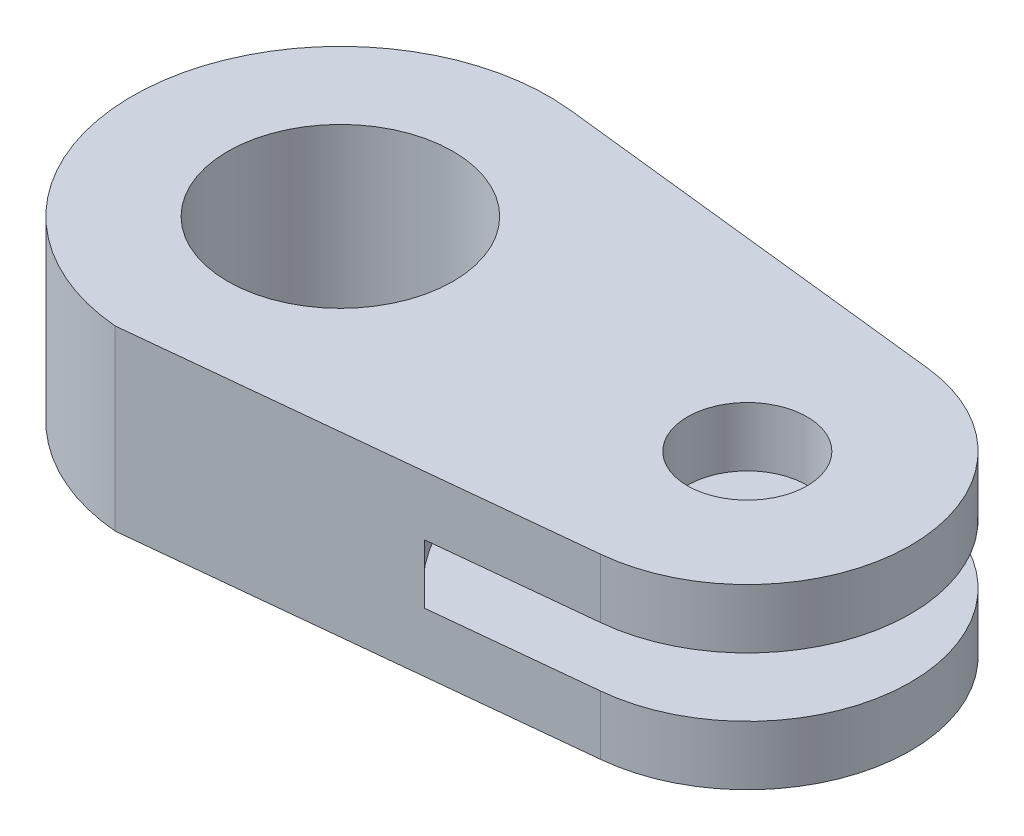
ISO-10303-21;
HEADER;
FILE_DESCRIPTION(('STEP AP214'),'2;1');
FILE_NAME('part.step','',(''),(''),'','','');
FILE_SCHEMA(('AUTOMOTIVE_DESIGN { 1 0 10303 214 1 1 1 1 }'));
ENDSEC;
DATA;
#1=APPLICATION_CONTEXT('core data for automotive mechanical design processes');
#2=APPLICATION_PROTOCOL_DEFINITION('international standard','automotive_design',2000,#1);
#3=PRODUCT_CONTEXT('',#1,'mechanical');
#4=PRODUCT('Part','Part','',(#3));
#5=PRODUCT_RELATED_PRODUCT_CATEGORY('part','',(#4));
#6=PRODUCT_DEFINITION_FORMATION('','',#4);
#7=PRODUCT_DEFINITION_CONTEXT('part definition',#1,'design');
#8=PRODUCT_DEFINITION('design','',#6,#7);
#9=PRODUCT_DEFINITION_SHAPE('','',#8);
#10=(LENGTH_UNIT() NAMED_UNIT(*) SI_UNIT(.MILLI.,.METRE.));
#11=(NAMED_UNIT(*) PLANE_ANGLE_UNIT() SI_UNIT($,.RADIAN.));
#12=(NAMED_UNIT(*) SI_UNIT($,.STERADIAN.) SOLID_ANGLE_UNIT());
#13=UNCERTAINTY_MEASURE_WITH_UNIT(LENGTH_MEASURE(1.E-05),#10,'distance_accuracy_value','');
#14=(GEOMETRIC_REPRESENTATION_CONTEXT(3) GLOBAL_UNCERTAINTY_ASSIGNED_CONTEXT((#13)) GLOBAL_UNIT_ASSIGNED_CONTEXT((#10,
#11,#12)) REPRESENTATION_CONTEXT('',''));
#15=CARTESIAN_POINT('',(0.,0.,0.));
#16=DIRECTION('',(0.,0.,1.));
#17=DIRECTION('',(1.,0.,0.));
#18=AXIS2_PLACEMENT_3D('',#15,#16,#17);
#19=CARTESIAN_POINT('',(-4.79511846540653,24.,56.0429470644385));
#20=DIRECTION('',(-0.101770831154283,0.,-0.994807869855364));
#21=DIRECTION('',(-0.994807869855364,0.,0.101770831154283));
#22=AXIS2_PLACEMENT_3D('',#19,#20,#21);
#23=PLANE('',#22);
#24=DIRECTION('',(0.994807869855364,0.,-0.101770831154283));
#25=VECTOR('',#24,1.);
#26=CARTESIAN_POINT('',(-4.79511846540653,-8.,56.0429470644385));
#27=LINE('',#26,#25);
#28=CARTESIAN_POINT('',(71.0228862102836,-8.,48.2866138204865));
#29=VERTEX_POINT('',#28);
#30=CARTESIAN_POINT('',(114.101954957562,-8.,43.87953908313));
#31=VERTEX_POINT('',#30);
#32=EDGE_CURVE('E132',#29,#31,#27,.T.);
#33=ORIENTED_EDGE('',*,*,#32,.F.);
#34=DIRECTION('',(0.,1.,0.));
#35=VECTOR('',#34,1.);
#36=CARTESIAN_POINT('',(71.0228862102836,-8.,48.2866138204865));
#37=LINE('',#36,#35);
#38=CARTESIAN_POINT('',(71.0228862102836,8.,48.2866138204865));
#39=VERTEX_POINT('',#38);
#40=EDGE_CURVE('E124',#29,#39,#37,.T.);
#41=ORIENTED_EDGE('',*,*,#40,.T.);
#42=DIRECTION('',(0.994807869855364,0.,-0.101770831154283));
#43=VECTOR('',#42,1.);
#44=CARTESIAN_POINT('',(-4.79511846540653,8.,56.0429470644385));
#45=LINE('',#44,#43);
#46=CARTESIAN_POINT('',(114.101954957562,8.,43.87953908313));
#47=VERTEX_POINT('',#46);
#48=EDGE_CURVE('E112',#39,#47,#45,.T.);
#49=ORIENTED_EDGE('',*,*,#48,.T.);
#50=DIRECTION('',(0.,-1.,0.));
#51=VECTOR('',#50,1.);
#52=CARTESIAN_POINT('',(114.101954957562,24.,43.87953908313));
#53=LINE('',#52,#51);
#54=CARTESIAN_POINT('',(114.101954957562,24.,43.87953908313));
#55=VERTEX_POINT('',#54);
#56=EDGE_CURVE('E189',#55,#47,#53,.T.);
#57=ORIENTED_EDGE('',*,*,#56,.F.);
#58=DIRECTION('',(0.994807869855364,0.,-0.101770831154283));
#59=VECTOR('',#58,1.);
#60=CARTESIAN_POINT('',(-4.79511846540653,24.,56.0429470644385));
#61=LINE('',#60,#59);
#62=CARTESIAN_POINT('',(-4.79511846540653,24.,56.0429470644385));
#63=VERTEX_POINT('',#62);
#64=EDGE_CURVE('E92',#63,#55,#61,.T.);
#65=ORIENTED_EDGE('',*,*,#64,.F.);
#66=DIRECTION('',(0.,-1.,0.));
#67=VECTOR('',#66,1.);
#68=CARTESIAN_POINT('',(-4.79511846540653,24.,56.0429470644385));
#69=LINE('',#68,#67);
#70=CARTESIAN_POINT('',(-4.79511846540653,-24.,56.0429470644385));
#71=VERTEX_POINT('',#70);
#72=EDGE_CURVE('E48',#63,#71,#69,.T.);
#73=ORIENTED_EDGE('',*,*,#72,.T.);
#74=DIRECTION('',(0.994807869855364,0.,-0.101770831154283));
#75=VECTOR('',#74,1.);
#76=CARTESIAN_POINT('',(-4.79511846540653,-24.,56.0429470644385));
#77=LINE('',#76,#75);
#78=CARTESIAN_POINT('',(114.101954957562,-24.,43.87953908313));
#79=VERTEX_POINT('',#78);
#80=EDGE_CURVE('E171',#71,#79,#77,.T.);
#81=ORIENTED_EDGE('',*,*,#80,.T.);
#82=EDGE_CURVE('E188',#31,#79,#53,.T.);
#83=ORIENTED_EDGE('',*,*,#82,.F.);
#84=EDGE_LOOP('',(#33,#41,#49,#57,#65,#73,#81,#83));
#85=FACE_BOUND('',#84,.T.);
#86=ADVANCED_FACE('F39',(#85),#23,.F.);
#87=CARTESIAN_POINT('',(109.912511121707,24.,0.));
#88=DIRECTION('',(0.,-1.,0.));
#89=DIRECTION('',(0.,0.,-1.));
#90=AXIS2_PLACEMENT_3D('',#87,#88,#89);
#91=CYLINDRICAL_SURFACE('',#90,44.0790810907137);
#92=CARTESIAN_POINT('',(109.912511121707,-8.,0.));
#93=DIRECTION('',(0.,1.,0.));
#94=DIRECTION('',(0.,0.,1.));
#95=AXIS2_PLACEMENT_3D('',#92,#93,#94);
#96=CIRCLE('',#95,44.0790810907137);
#97=CARTESIAN_POINT('',(114.792593033983,-8.,-43.8081064453964));
#98=VERTEX_POINT('',#97);
#99=EDGE_CURVE('E141',#31,#98,#96,.T.);
#100=ORIENTED_EDGE('',*,*,#99,.F.);
#101=ORIENTED_EDGE('',*,*,#82,.T.);
#102=CARTESIAN_POINT('',(109.912511121707,-24.,0.));
#103=DIRECTION('',(0.,1.,0.));
#104=DIRECTION('',(0.,0.,-1.));
#105=AXIS2_PLACEMENT_3D('',#102,#103,#104);
#106=CIRCLE('',#105,44.0790810907137);
#107=CARTESIAN_POINT('',(114.792593033983,-24.,-43.8081064453964));
#108=VERTEX_POINT('',#107);
#109=EDGE_CURVE('E175',#79,#108,#106,.T.);
#110=ORIENTED_EDGE('',*,*,#109,.T.);
#111=DIRECTION('',(0.,-1.,0.));
#112=VECTOR('',#111,1.);
#113=CARTESIAN_POINT('',(114.792593033983,24.,-43.8081064453964));
#114=LINE('',#113,#112);
#115=EDGE_CURVE('E183',#98,#108,#114,.T.);
#116=ORIENTED_EDGE('',*,*,#115,.F.);
#117=EDGE_LOOP('',(#100,#101,#110,#116));
#118=FACE_BOUND('',#117,.T.);
#119=ADVANCED_FACE('F233',(#118),#91,.T.);
#120=CARTESIAN_POINT('',(6.22729498689375,24.,-55.9019308603106));
#121=DIRECTION('',(-0.110711970202674,0.,0.993852534158786));
#122=DIRECTION('',(0.993852534158787,0.,0.110711970202674));
#123=AXIS2_PLACEMENT_3D('',#120,#121,#122);
#124=PLANE('',#123);
#125=DIRECTION('',(-0.993852534158787,0.,-0.110711970202674));
#126=VECTOR('',#125,1.);
#127=CARTESIAN_POINT('',(6.22729498689375,-8.,-55.9019308603106));
#128=LINE('',#127,#126);
#129=CARTESIAN_POINT('',(71.4597721913682,-8.,-48.63524307285));
#130=VERTEX_POINT('',#129);
#131=EDGE_CURVE('E200',#98,#130,#128,.T.);
#132=ORIENTED_EDGE('',*,*,#131,.F.);
#133=ORIENTED_EDGE('',*,*,#115,.T.);
#134=DIRECTION('',(-0.993852534158786,0.,-0.110711970202674));
#135=VECTOR('',#134,1.);
#136=CARTESIAN_POINT('',(6.22729498689375,-24.,-55.9019308603106));
#137=LINE('',#136,#135);
#138=CARTESIAN_POINT('',(6.22729498689375,-24.,-55.9019308603106));
#139=VERTEX_POINT('',#138);
#140=EDGE_CURVE('E84',#108,#139,#137,.T.);
#141=ORIENTED_EDGE('',*,*,#140,.T.);
#142=DIRECTION('',(0.,-1.,0.));
#143=VECTOR('',#142,1.);
#144=CARTESIAN_POINT('',(6.22729498689375,24.,-55.9019308603106));
#145=LINE('',#144,#143);
#146=CARTESIAN_POINT('',(6.22729498689375,24.,-55.9019308603106));
#147=VERTEX_POINT('',#146);
#148=EDGE_CURVE('E167',#147,#139,#145,.T.);
#149=ORIENTED_EDGE('',*,*,#148,.F.);
#150=DIRECTION('',(-0.993852534158786,0.,-0.110711970202674));
#151=VECTOR('',#150,1.);
#152=CARTESIAN_POINT('',(6.22729498689375,24.,-55.9019308603106));
#153=LINE('',#152,#151);
#154=CARTESIAN_POINT('',(114.792593033983,24.,-43.8081064453964));
#155=VERTEX_POINT('',#154);
#156=EDGE_CURVE('E64',#155,#147,#153,.T.);
#157=ORIENTED_EDGE('',*,*,#156,.F.);
#158=CARTESIAN_POINT('',(114.792593033983,8.,-43.8081064453964));
#159=VERTEX_POINT('',#158);
#160=EDGE_CURVE('E184',#155,#159,#114,.T.);
#161=ORIENTED_EDGE('',*,*,#160,.T.);
#162=DIRECTION('',(-0.993852534158787,0.,-0.110711970202674));
#163=VECTOR('',#162,1.);
#164=CARTESIAN_POINT('',(6.22729498689375,8.,-55.9019308603106));
#165=LINE('',#164,#163);
#166=CARTESIAN_POINT('',(71.4597721913682,8.,-48.63524307285));
#167=VERTEX_POINT('',#166);
#168=EDGE_CURVE('E197',#159,#167,#165,.T.);
#169=ORIENTED_EDGE('',*,*,#168,.T.);
#170=DIRECTION('',(0.,1.,0.));
#171=VECTOR('',#170,1.);
#172=CARTESIAN_POINT('',(71.4597721913682,-8.,-48.63524307285));
#173=LINE('',#172,#171);
#174=EDGE_CURVE('E11',#167,#130,#173,.F.);
#175=ORIENTED_EDGE('',*,*,#174,.T.);
#176=EDGE_LOOP('',(#132,#133,#141,#149,#157,#161,#169,#175));
#177=FACE_BOUND('',#176,.T.);
#178=ADVANCED_FACE('F216',(#177),#124,.F.);
#179=CARTESIAN_POINT('',(109.912511121707,24.,0.));
#180=DIRECTION('',(0.,-1.,0.));
#181=DIRECTION('',(0.,0.,-1.));
#182=AXIS2_PLACEMENT_3D('',#179,#180,#181);
#183=CYLINDRICAL_SURFACE('',#182,16.1557514609619);
#184=CARTESIAN_POINT('',(109.912511121707,-24.,0.));
#185=DIRECTION('',(0.,1.,0.));
#186=DIRECTION('',(0.,0.,1.));
#187=AXIS2_PLACEMENT_3D('',#184,#185,#186);
#188=CIRCLE('',#187,16.1557514609619);
#189=CARTESIAN_POINT('',(109.912511121707,-24.,16.1557514609619));
#190=VERTEX_POINT('',#189);
#191=EDGE_CURVE('E134',#190,#190,#188,.T.);
#192=ORIENTED_EDGE('',*,*,#191,.F.);
#193=EDGE_LOOP('',(#192));
#194=FACE_BOUND('',#193,.T.);
#195=CARTESIAN_POINT('',(109.912511121707,-8.,0.));
#196=DIRECTION('',(0.,1.,0.));
#197=DIRECTION('',(0.,0.,1.));
#198=AXIS2_PLACEMENT_3D('',#195,#196,#197);
#199=CIRCLE('',#198,16.1557514609619);
#200=CARTESIAN_POINT('',(109.912511121707,-8.,16.1557514609619));
#201=VERTEX_POINT('',#200);
#202=EDGE_CURVE('E119',#201,#201,#199,.T.);
#203=ORIENTED_EDGE('',*,*,#202,.T.);
#204=EDGE_LOOP('',(#203));
#205=FACE_BOUND('',#204,.T.);
#206=ADVANCED_FACE('F242',(#194,#205),#183,.F.);
#207=CARTESIAN_POINT('',(0.,24.,0.));
#208=DIRECTION('',(0.,1.,0.));
#209=DIRECTION('',(0.,0.,1.));
#210=AXIS2_PLACEMENT_3D('',#207,#208,#209);
#211=PLANE('',#210);
#212=CARTESIAN_POINT('',(0.,24.,0.));
#213=DIRECTION('',(0.,1.,0.));
#214=DIRECTION('',(0.,0.,1.));
#215=AXIS2_PLACEMENT_3D('',#212,#213,#214);
#216=CIRCLE('',#215,30.4289963578048);
#217=CARTESIAN_POINT('',(0.,24.,30.4289963578048));
#218=VERTEX_POINT('',#217);
#219=EDGE_CURVE('E149',#218,#218,#216,.T.);
#220=ORIENTED_EDGE('',*,*,#219,.F.);
#221=EDGE_LOOP('',(#220));
#222=FACE_BOUND('',#221,.T.);
#223=CARTESIAN_POINT('',(0.,24.,0.));
#224=DIRECTION('',(0.,1.,0.));
#225=DIRECTION('',(0.,0.,1.));
#226=AXIS2_PLACEMENT_3D('',#223,#224,#225);
#227=CIRCLE('',#226,56.2477117469212);
#228=EDGE_CURVE('E157',#147,#63,#227,.T.);
#229=ORIENTED_EDGE('',*,*,#228,.T.);
#230=ORIENTED_EDGE('',*,*,#64,.T.);
#231=CARTESIAN_POINT('',(109.912511121707,24.,0.));
#232=DIRECTION('',(0.,1.,0.));
#233=DIRECTION('',(0.,0.,-1.));
#234=AXIS2_PLACEMENT_3D('',#231,#232,#233);
#235=CIRCLE('',#234,44.0790810907137);
#236=EDGE_CURVE('E162',#55,#155,#235,.T.);
#237=ORIENTED_EDGE('',*,*,#236,.T.);
#238=ORIENTED_EDGE('',*,*,#156,.T.);
#239=EDGE_LOOP('',(#229,#230,#237,#238));
#240=FACE_BOUND('',#239,.T.);
#241=CARTESIAN_POINT('',(109.912511121707,24.,0.));
#242=DIRECTION('',(0.,1.,0.));
#243=DIRECTION('',(0.,0.,1.));
#244=AXIS2_PLACEMENT_3D('',#241,#242,#243);
#245=CIRCLE('',#244,16.1557514609619);
#246=CARTESIAN_POINT('',(109.912511121707,24.,16.1557514609619));
#247=VERTEX_POINT('',#246);
#248=EDGE_CURVE('E139',#247,#247,#245,.T.);
#249=ORIENTED_EDGE('',*,*,#248,.F.);
#250=EDGE_LOOP('',(#249));
#251=FACE_BOUND('',#250,.T.);
#252=ADVANCED_FACE('F222',(#222,#240,#251),#211,.T.);
#253=CARTESIAN_POINT('',(0.,-24.,0.));
#254=DIRECTION('',(0.,1.,0.));
#255=DIRECTION('',(0.,0.,1.));
#256=AXIS2_PLACEMENT_3D('',#253,#254,#255);
#257=PLANE('',#256);
#258=CARTESIAN_POINT('',(0.,-24.,0.));
#259=DIRECTION('',(0.,1.,0.));
#260=DIRECTION('',(0.,0.,1.));
#261=AXIS2_PLACEMENT_3D('',#258,#259,#260);
#262=CIRCLE('',#261,56.2477117469212);
#263=EDGE_CURVE('E153',#139,#71,#262,.T.);
#264=ORIENTED_EDGE('',*,*,#263,.F.);
#265=ORIENTED_EDGE('',*,*,#140,.F.);
#266=ORIENTED_EDGE('',*,*,#109,.F.);
#267=ORIENTED_EDGE('',*,*,#80,.F.);
#268=EDGE_LOOP('',(#264,#265,#266,#267));
#269=FACE_BOUND('',#268,.T.);
#270=CARTESIAN_POINT('',(0.,-24.,0.));
#271=DIRECTION('',(0.,1.,0.));
#272=DIRECTION('',(0.,0.,1.));
#273=AXIS2_PLACEMENT_3D('',#270,#271,#272);
#274=CIRCLE('',#273,30.4289963578048);
#275=CARTESIAN_POINT('',(0.,-24.,30.4289963578048));
#276=VERTEX_POINT('',#275);
#277=EDGE_CURVE('E147',#276,#276,#274,.T.);
#278=ORIENTED_EDGE('',*,*,#277,.T.);
#279=EDGE_LOOP('',(#278));
#280=FACE_BOUND('',#279,.T.);
#281=ORIENTED_EDGE('',*,*,#191,.T.);
#282=EDGE_LOOP('',(#281));
#283=FACE_BOUND('',#282,.T.);
#284=ADVANCED_FACE('F230',(#269,#280,#283),#257,.F.);
#285=CARTESIAN_POINT('',(0.,24.,0.));
#286=DIRECTION('',(0.,-1.,0.));
#287=DIRECTION('',(0.,0.,-1.));
#288=AXIS2_PLACEMENT_3D('',#285,#286,#287);
#289=CYLINDRICAL_SURFACE('',#288,56.2477117469212);
#290=ORIENTED_EDGE('',*,*,#263,.T.);
#291=ORIENTED_EDGE('',*,*,#72,.F.);
#292=ORIENTED_EDGE('',*,*,#228,.F.);
#293=ORIENTED_EDGE('',*,*,#148,.T.);
#294=EDGE_LOOP('',(#290,#291,#292,#293));
#295=FACE_BOUND('',#294,.T.);
#296=ADVANCED_FACE('F41',(#295),#289,.T.);
#297=ORIENTED_EDGE('',*,*,#56,.T.);
#298=CARTESIAN_POINT('',(109.912511121707,8.,0.));
#299=DIRECTION('',(0.,1.,0.));
#300=DIRECTION('',(0.,0.,1.));
#301=AXIS2_PLACEMENT_3D('',#298,#299,#300);
#302=CIRCLE('',#301,44.0790810907137);
#303=EDGE_CURVE('E115',#47,#159,#302,.T.);
#304=ORIENTED_EDGE('',*,*,#303,.T.);
#305=ORIENTED_EDGE('',*,*,#160,.F.);
#306=ORIENTED_EDGE('',*,*,#236,.F.);
#307=EDGE_LOOP('',(#297,#304,#305,#306));
#308=FACE_BOUND('',#307,.T.);
#309=ADVANCED_FACE('F220',(#308),#91,.T.);
#310=CARTESIAN_POINT('',(0.,24.,0.));
#311=DIRECTION('',(0.,-1.,0.));
#312=DIRECTION('',(0.,0.,-1.));
#313=AXIS2_PLACEMENT_3D('',#310,#311,#312);
#314=CYLINDRICAL_SURFACE('',#313,30.4289963578048);
#315=ORIENTED_EDGE('',*,*,#219,.T.);
#316=EDGE_LOOP('',(#315));
#317=FACE_BOUND('',#316,.T.);
#318=ORIENTED_EDGE('',*,*,#277,.F.);
#319=EDGE_LOOP('',(#318));
#320=FACE_BOUND('',#319,.T.);
#321=ADVANCED_FACE('F245',(#317,#320),#314,.F.);
#322=CARTESIAN_POINT('',(109.912511121707,8.,0.));
#323=DIRECTION('',(0.,1.,0.));
#324=DIRECTION('',(0.,0.,1.));
#325=AXIS2_PLACEMENT_3D('',#322,#323,#324);
#326=CIRCLE('',#325,16.1557514609619);
#327=CARTESIAN_POINT('',(109.912511121707,8.,16.1557514609619));
#328=VERTEX_POINT('',#327);
#329=EDGE_CURVE('E194',#328,#328,#326,.T.);
#330=ORIENTED_EDGE('',*,*,#329,.F.);
#331=EDGE_LOOP('',(#330));
#332=FACE_BOUND('',#331,.T.);
#333=ORIENTED_EDGE('',*,*,#248,.T.);
#334=EDGE_LOOP('',(#333));
#335=FACE_BOUND('',#334,.T.);
#336=ADVANCED_FACE('F250',(#332,#335),#183,.F.);
#337=CARTESIAN_POINT('',(109.912511121707,-8.,0.));
#338=DIRECTION('',(0.,1.,0.));
#339=DIRECTION('',(0.,0.,1.));
#340=AXIS2_PLACEMENT_3D('',#337,#338,#339);
#341=CYLINDRICAL_SURFACE('',#340,62.);
#342=CARTESIAN_POINT('',(109.912511121707,-8.,0.));
#343=DIRECTION('',(0.,1.,0.));
#344=DIRECTION('',(0.,0.,1.));
#345=AXIS2_PLACEMENT_3D('',#342,#343,#344);
#346=CIRCLE('',#345,62.);
#347=EDGE_CURVE('E128',#130,#29,#346,.T.);
#348=ORIENTED_EDGE('',*,*,#347,.F.);
#349=ORIENTED_EDGE('',*,*,#174,.F.);
#350=CARTESIAN_POINT('',(109.912511121707,8.,0.));
#351=DIRECTION('',(0.,1.,0.));
#352=DIRECTION('',(0.,0.,1.));
#353=AXIS2_PLACEMENT_3D('',#350,#351,#352);
#354=CIRCLE('',#353,62.);
#355=EDGE_CURVE('E55',#167,#39,#354,.T.);
#356=ORIENTED_EDGE('',*,*,#355,.T.);
#357=ORIENTED_EDGE('',*,*,#40,.F.);
#358=EDGE_LOOP('',(#348,#349,#356,#357));
#359=FACE_BOUND('',#358,.T.);
#360=ADVANCED_FACE('F123',(#359),#341,.F.);
#361=CARTESIAN_POINT('',(109.912511121707,-8.,0.));
#362=DIRECTION('',(0.,1.,0.));
#363=DIRECTION('',(0.,0.,1.));
#364=AXIS2_PLACEMENT_3D('',#361,#362,#363);
#365=PLANE('',#364);
#366=ORIENTED_EDGE('',*,*,#202,.F.);
#367=EDGE_LOOP('',(#366));
#368=FACE_BOUND('',#367,.T.);
#369=ORIENTED_EDGE('',*,*,#32,.T.);
#370=ORIENTED_EDGE('',*,*,#99,.T.);
#371=ORIENTED_EDGE('',*,*,#131,.T.);
#372=ORIENTED_EDGE('',*,*,#347,.T.);
#373=EDGE_LOOP('',(#369,#370,#371,#372));
#374=FACE_BOUND('',#373,.T.);
#375=ADVANCED_FACE('F214',(#368,#374),#365,.T.);
#376=CARTESIAN_POINT('',(109.912511121707,8.,0.));
#377=DIRECTION('',(0.,1.,0.));
#378=DIRECTION('',(0.,0.,1.));
#379=AXIS2_PLACEMENT_3D('',#376,#377,#378);
#380=PLANE('',#379);
#381=ORIENTED_EDGE('',*,*,#329,.T.);
#382=EDGE_LOOP('',(#381));
#383=FACE_BOUND('',#382,.T.);
#384=ORIENTED_EDGE('',*,*,#355,.F.);
#385=ORIENTED_EDGE('',*,*,#168,.F.);
#386=ORIENTED_EDGE('',*,*,#303,.F.);
#387=ORIENTED_EDGE('',*,*,#48,.F.);
#388=EDGE_LOOP('',(#384,#385,#386,#387));
#389=FACE_BOUND('',#388,.T.);
#390=ADVANCED_FACE('F113',(#383,#389),#380,.F.);
#391=CLOSED_SHELL('',(#86,#119,#178,#206,#252,#284,#296,#309,#321,#336,#360,#375,#390));
#392=MANIFOLD_SOLID_BREP('B2',#391);
#393=ADVANCED_BREP_SHAPE_REPRESENTATION('',(#18,#392),#14);
#394=SHAPE_DEFINITION_REPRESENTATION(#9,#393);
ENDSEC;
END-ISO-10303-21;
